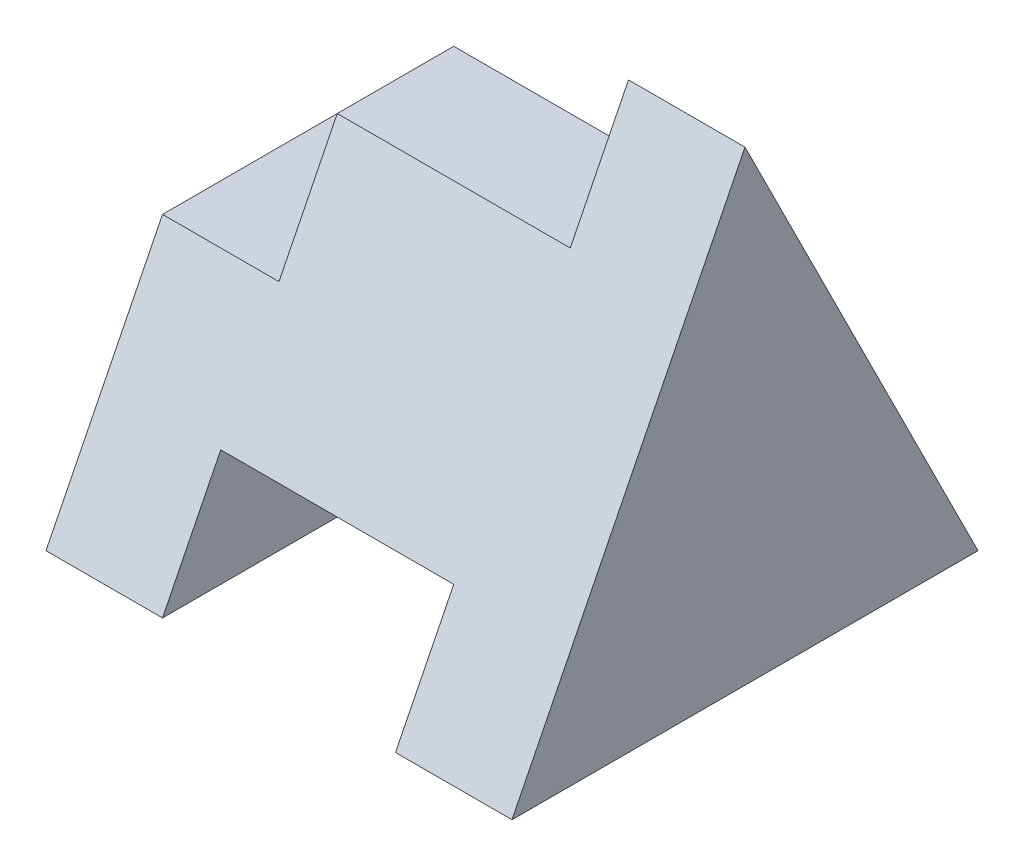
ISO-10303-21;
HEADER;
FILE_DESCRIPTION(('STEP AP214'),'2;1');
FILE_NAME('part.step','',(''),(''),'','','');
FILE_SCHEMA(('AUTOMOTIVE_DESIGN { 1 0 10303 214 1 1 1 1 }'));
ENDSEC;
DATA;
#1=APPLICATION_CONTEXT('core data for automotive mechanical design processes');
#2=APPLICATION_PROTOCOL_DEFINITION('international standard','automotive_design',2000,#1);
#3=PRODUCT_CONTEXT('',#1,'mechanical');
#4=PRODUCT('Part','Part','',(#3));
#5=PRODUCT_RELATED_PRODUCT_CATEGORY('part','',(#4));
#6=PRODUCT_DEFINITION_FORMATION('','',#4);
#7=PRODUCT_DEFINITION_CONTEXT('part definition',#1,'design');
#8=PRODUCT_DEFINITION('design','',#6,#7);
#9=PRODUCT_DEFINITION_SHAPE('','',#8);
#10=(LENGTH_UNIT() NAMED_UNIT(*) SI_UNIT(.MILLI.,.METRE.));
#11=(NAMED_UNIT(*) PLANE_ANGLE_UNIT() SI_UNIT($,.RADIAN.));
#12=(NAMED_UNIT(*) SI_UNIT($,.STERADIAN.) SOLID_ANGLE_UNIT());
#13=UNCERTAINTY_MEASURE_WITH_UNIT(LENGTH_MEASURE(1.E-05),#10,'distance_accuracy_value','');
#14=(GEOMETRIC_REPRESENTATION_CONTEXT(3) GLOBAL_UNCERTAINTY_ASSIGNED_CONTEXT((#13)) GLOBAL_UNIT_ASSIGNED_CONTEXT((#10,
#11,#12)) REPRESENTATION_CONTEXT('',''));
#15=CARTESIAN_POINT('',(0.,0.,0.));
#16=DIRECTION('',(0.,0.,1.));
#17=DIRECTION('',(1.,0.,0.));
#18=AXIS2_PLACEMENT_3D('',#15,#16,#17);
#19=CARTESIAN_POINT('',(1.,1.,4.));
#20=DIRECTION('',(-1.,0.,0.));
#21=DIRECTION('',(0.,0.,1.));
#22=AXIS2_PLACEMENT_3D('',#19,#20,#21);
#23=PLANE('',#22);
#24=DIRECTION('',(0.,0.894427190999916,-0.447213595499958));
#25=VECTOR('',#24,1.);
#26=CARTESIAN_POINT('',(1.,0.8,3.6));
#27=LINE('',#26,#25);
#28=CARTESIAN_POINT('',(0.999999999999999,0.,4.));
#29=VERTEX_POINT('',#28);
#30=CARTESIAN_POINT('',(1.,1.,3.5));
#31=VERTEX_POINT('',#30);
#32=EDGE_CURVE('E196',#29,#31,#27,.T.);
#33=ORIENTED_EDGE('',*,*,#32,.F.);
#34=DIRECTION('',(0.,0.,-1.));
#35=VECTOR('',#34,1.);
#36=CARTESIAN_POINT('',(1.,0.,4.));
#37=LINE('',#36,#35);
#38=CARTESIAN_POINT('',(0.999999999999999,0.,0.));
#39=VERTEX_POINT('',#38);
#40=EDGE_CURVE('E12',#29,#39,#37,.T.);
#41=ORIENTED_EDGE('',*,*,#40,.T.);
#42=DIRECTION('',(0.,-0.894427190999916,-0.447213595499958));
#43=VECTOR('',#42,1.);
#44=CARTESIAN_POINT('',(1.,2.4,1.2));
#45=LINE('',#44,#43);
#46=CARTESIAN_POINT('',(1.,1.,0.5));
#47=VERTEX_POINT('',#46);
#48=EDGE_CURVE('E147',#47,#39,#45,.T.);
#49=ORIENTED_EDGE('',*,*,#48,.F.);
#50=DIRECTION('',(0.,0.,-1.));
#51=VECTOR('',#50,1.);
#52=CARTESIAN_POINT('',(1.,1.,4.));
#53=LINE('',#52,#51);
#54=EDGE_CURVE('E42',#31,#47,#53,.T.);
#55=ORIENTED_EDGE('',*,*,#54,.F.);
#56=EDGE_LOOP('',(#33,#41,#49,#55));
#57=FACE_BOUND('',#56,.T.);
#58=ADVANCED_FACE('F34',(#57),#23,.F.);
#59=CARTESIAN_POINT('',(3.,1.,4.));
#60=DIRECTION('',(0.,1.,0.));
#61=DIRECTION('',(-1.,0.,0.));
#62=AXIS2_PLACEMENT_3D('',#59,#60,#61);
#63=PLANE('',#62);
#64=DIRECTION('',(1.,0.,0.));
#65=VECTOR('',#64,1.);
#66=CARTESIAN_POINT('',(3.,1.,3.5));
#67=LINE('',#66,#65);
#68=CARTESIAN_POINT('',(3.,1.,3.5));
#69=VERTEX_POINT('',#68);
#70=EDGE_CURVE('E198',#31,#69,#67,.T.);
#71=ORIENTED_EDGE('',*,*,#70,.F.);
#72=ORIENTED_EDGE('',*,*,#54,.T.);
#73=DIRECTION('',(-1.,0.,0.));
#74=VECTOR('',#73,1.);
#75=CARTESIAN_POINT('',(3.,1.,0.5));
#76=LINE('',#75,#74);
#77=CARTESIAN_POINT('',(3.,1.,0.499999999999999));
#78=VERTEX_POINT('',#77);
#79=EDGE_CURVE('E175',#78,#47,#76,.T.);
#80=ORIENTED_EDGE('',*,*,#79,.F.);
#81=DIRECTION('',(0.,0.,-1.));
#82=VECTOR('',#81,1.);
#83=CARTESIAN_POINT('',(3.,1.,4.));
#84=LINE('',#83,#82);
#85=EDGE_CURVE('E164',#69,#78,#84,.T.);
#86=ORIENTED_EDGE('',*,*,#85,.F.);
#87=EDGE_LOOP('',(#71,#72,#80,#86));
#88=FACE_BOUND('',#87,.T.);
#89=ADVANCED_FACE('F178',(#88),#63,.F.);
#90=CARTESIAN_POINT('',(3.,0.,4.));
#91=DIRECTION('',(1.,0.,0.));
#92=DIRECTION('',(0.,0.,-1.));
#93=AXIS2_PLACEMENT_3D('',#90,#91,#92);
#94=PLANE('',#93);
#95=DIRECTION('',(0.,-0.894427190999916,0.447213595499958));
#96=VECTOR('',#95,1.);
#97=CARTESIAN_POINT('',(3.,0.,4.));
#98=LINE('',#97,#96);
#99=CARTESIAN_POINT('',(3.,0.,4.));
#100=VERTEX_POINT('',#99);
#101=EDGE_CURVE('E173',#69,#100,#98,.T.);
#102=ORIENTED_EDGE('',*,*,#101,.F.);
#103=ORIENTED_EDGE('',*,*,#85,.T.);
#104=DIRECTION('',(0.,0.894427190999916,0.447213595499958));
#105=VECTOR('',#104,1.);
#106=CARTESIAN_POINT('',(3.,1.6,0.799999999999999));
#107=LINE('',#106,#105);
#108=CARTESIAN_POINT('',(3.,0.,0.));
#109=VERTEX_POINT('',#108);
#110=EDGE_CURVE('E172',#109,#78,#107,.T.);
#111=ORIENTED_EDGE('',*,*,#110,.F.);
#112=DIRECTION('',(0.,0.,-1.));
#113=VECTOR('',#112,1.);
#114=CARTESIAN_POINT('',(3.,0.,4.));
#115=LINE('',#114,#113);
#116=EDGE_CURVE('E161',#100,#109,#115,.T.);
#117=ORIENTED_EDGE('',*,*,#116,.F.);
#118=EDGE_LOOP('',(#102,#103,#111,#117));
#119=FACE_BOUND('',#118,.T.);
#120=ADVANCED_FACE('F170',(#119),#94,.F.);
#121=CARTESIAN_POINT('',(4.,4.,4.));
#122=DIRECTION('',(-1.,0.,0.));
#123=DIRECTION('',(0.,-1.,0.));
#124=AXIS2_PLACEMENT_3D('',#121,#122,#123);
#125=PLANE('',#124);
#126=DIRECTION('',(0.,0.894427190999916,-0.447213595499958));
#127=VECTOR('',#126,1.);
#128=CARTESIAN_POINT('',(4.,3.2,2.4));
#129=LINE('',#128,#127);
#130=CARTESIAN_POINT('',(4.,0.,4.));
#131=VERTEX_POINT('',#130);
#132=CARTESIAN_POINT('',(4.,4.,2.));
#133=VERTEX_POINT('',#132);
#134=EDGE_CURVE('E201',#131,#133,#129,.T.);
#135=ORIENTED_EDGE('',*,*,#134,.F.);
#136=DIRECTION('',(0.,0.,-1.));
#137=VECTOR('',#136,1.);
#138=CARTESIAN_POINT('',(4.,0.,4.));
#139=LINE('',#138,#137);
#140=CARTESIAN_POINT('',(4.,0.,0.));
#141=VERTEX_POINT('',#140);
#142=EDGE_CURVE('E158',#131,#141,#139,.T.);
#143=ORIENTED_EDGE('',*,*,#142,.T.);
#144=DIRECTION('',(0.,-0.894427190999916,-0.447213595499958));
#145=VECTOR('',#144,1.);
#146=CARTESIAN_POINT('',(4.,4.8,2.4));
#147=LINE('',#146,#145);
#148=EDGE_CURVE('E49',#133,#141,#147,.T.);
#149=ORIENTED_EDGE('',*,*,#148,.F.);
#150=EDGE_LOOP('',(#135,#143,#149));
#151=FACE_BOUND('',#150,.T.);
#152=ADVANCED_FACE('F229',(#151),#125,.F.);
#153=CARTESIAN_POINT('',(3.,3.,4.));
#154=DIRECTION('',(1.,0.,0.));
#155=DIRECTION('',(0.,0.,-1.));
#156=AXIS2_PLACEMENT_3D('',#153,#154,#155);
#157=PLANE('',#156);
#158=DIRECTION('',(0.,-0.894427190999916,0.447213595499958));
#159=VECTOR('',#158,1.);
#160=CARTESIAN_POINT('',(3.,2.4,2.8));
#161=LINE('',#160,#159);
#162=CARTESIAN_POINT('',(3.,4.,2.));
#163=VERTEX_POINT('',#162);
#164=CARTESIAN_POINT('',(3.,3.,2.5));
#165=VERTEX_POINT('',#164);
#166=EDGE_CURVE('E203',#163,#165,#161,.T.);
#167=ORIENTED_EDGE('',*,*,#166,.F.);
#168=DIRECTION('',(0.,0.894427190999916,0.447213595499958));
#169=VECTOR('',#168,1.);
#170=CARTESIAN_POINT('',(3.,4.,2.));
#171=LINE('',#170,#169);
#172=CARTESIAN_POINT('',(3.,3.,1.5));
#173=VERTEX_POINT('',#172);
#174=EDGE_CURVE('E181',#173,#163,#171,.T.);
#175=ORIENTED_EDGE('',*,*,#174,.F.);
#176=DIRECTION('',(0.,0.,-1.));
#177=VECTOR('',#176,1.);
#178=CARTESIAN_POINT('',(3.,3.,4.));
#179=LINE('',#178,#177);
#180=EDGE_CURVE('E156',#165,#173,#179,.T.);
#181=ORIENTED_EDGE('',*,*,#180,.F.);
#182=EDGE_LOOP('',(#167,#175,#181));
#183=FACE_BOUND('',#182,.T.);
#184=ADVANCED_FACE('F226',(#183),#157,.F.);
#185=CARTESIAN_POINT('',(1.,3.,4.));
#186=DIRECTION('',(0.,-1.,0.));
#187=DIRECTION('',(0.,0.,-1.));
#188=AXIS2_PLACEMENT_3D('',#185,#186,#187);
#189=PLANE('',#188);
#190=DIRECTION('',(-1.,0.,0.));
#191=VECTOR('',#190,1.);
#192=CARTESIAN_POINT('',(1.,3.,2.5));
#193=LINE('',#192,#191);
#194=CARTESIAN_POINT('',(1.,3.,2.5));
#195=VERTEX_POINT('',#194);
#196=EDGE_CURVE('E205',#165,#195,#193,.T.);
#197=ORIENTED_EDGE('',*,*,#196,.F.);
#198=ORIENTED_EDGE('',*,*,#180,.T.);
#199=DIRECTION('',(1.,0.,0.));
#200=VECTOR('',#199,1.);
#201=CARTESIAN_POINT('',(1.,3.,1.5));
#202=LINE('',#201,#200);
#203=CARTESIAN_POINT('',(1.,3.,1.5));
#204=VERTEX_POINT('',#203);
#205=EDGE_CURVE('E184',#204,#173,#202,.T.);
#206=ORIENTED_EDGE('',*,*,#205,.F.);
#207=DIRECTION('',(0.,0.,-1.));
#208=VECTOR('',#207,1.);
#209=CARTESIAN_POINT('',(1.,3.,4.));
#210=LINE('',#209,#208);
#211=EDGE_CURVE('E154',#195,#204,#210,.T.);
#212=ORIENTED_EDGE('',*,*,#211,.F.);
#213=EDGE_LOOP('',(#197,#198,#206,#212));
#214=FACE_BOUND('',#213,.T.);
#215=ADVANCED_FACE('F222',(#214),#189,.F.);
#216=CARTESIAN_POINT('',(1.,2.,4.));
#217=DIRECTION('',(1.,0.,0.));
#218=DIRECTION('',(0.,0.,-1.));
#219=AXIS2_PLACEMENT_3D('',#216,#217,#218);
#220=PLANE('',#219);
#221=DIRECTION('',(0.,-0.894427190999916,0.447213595499958));
#222=VECTOR('',#221,1.);
#223=CARTESIAN_POINT('',(1.,1.6,3.2));
#224=LINE('',#223,#222);
#225=CARTESIAN_POINT('',(1.,2.,3.));
#226=VERTEX_POINT('',#225);
#227=EDGE_CURVE('E207',#195,#226,#224,.T.);
#228=ORIENTED_EDGE('',*,*,#227,.F.);
#229=ORIENTED_EDGE('',*,*,#211,.T.);
#230=DIRECTION('',(0.,0.894427190999916,0.447213595499958));
#231=VECTOR('',#230,1.);
#232=CARTESIAN_POINT('',(1.,3.2,1.6));
#233=LINE('',#232,#231);
#234=CARTESIAN_POINT('',(1.,2.,1.));
#235=VERTEX_POINT('',#234);
#236=EDGE_CURVE('E187',#235,#204,#233,.T.);
#237=ORIENTED_EDGE('',*,*,#236,.F.);
#238=DIRECTION('',(0.,0.,-1.));
#239=VECTOR('',#238,1.);
#240=CARTESIAN_POINT('',(1.,2.,4.));
#241=LINE('',#240,#239);
#242=EDGE_CURVE('E152',#226,#235,#241,.T.);
#243=ORIENTED_EDGE('',*,*,#242,.F.);
#244=EDGE_LOOP('',(#228,#229,#237,#243));
#245=FACE_BOUND('',#244,.T.);
#246=ADVANCED_FACE('F218',(#245),#220,.F.);
#247=CARTESIAN_POINT('',(0.,2.,4.));
#248=DIRECTION('',(0.,-1.,0.));
#249=DIRECTION('',(1.,0.,0.));
#250=AXIS2_PLACEMENT_3D('',#247,#248,#249);
#251=PLANE('',#250);
#252=DIRECTION('',(-1.,0.,0.));
#253=VECTOR('',#252,1.);
#254=CARTESIAN_POINT('',(0.,2.,3.));
#255=LINE('',#254,#253);
#256=CARTESIAN_POINT('',(0.,2.,3.));
#257=VERTEX_POINT('',#256);
#258=EDGE_CURVE('E125',#226,#257,#255,.T.);
#259=ORIENTED_EDGE('',*,*,#258,.F.);
#260=ORIENTED_EDGE('',*,*,#242,.T.);
#261=DIRECTION('',(1.,0.,0.));
#262=VECTOR('',#261,1.);
#263=CARTESIAN_POINT('',(0.,2.,1.));
#264=LINE('',#263,#262);
#265=CARTESIAN_POINT('',(0.,2.,1.));
#266=VERTEX_POINT('',#265);
#267=EDGE_CURVE('E190',#266,#235,#264,.T.);
#268=ORIENTED_EDGE('',*,*,#267,.F.);
#269=DIRECTION('',(0.,0.,-1.));
#270=VECTOR('',#269,1.);
#271=CARTESIAN_POINT('',(0.,2.,4.));
#272=LINE('',#271,#270);
#273=EDGE_CURVE('E137',#257,#266,#272,.T.);
#274=ORIENTED_EDGE('',*,*,#273,.F.);
#275=EDGE_LOOP('',(#259,#260,#268,#274));
#276=FACE_BOUND('',#275,.T.);
#277=ADVANCED_FACE('F215',(#276),#251,.F.);
#278=CARTESIAN_POINT('',(0.,0.,4.));
#279=DIRECTION('',(1.,0.,0.));
#280=DIRECTION('',(0.,0.,-1.));
#281=AXIS2_PLACEMENT_3D('',#278,#279,#280);
#282=PLANE('',#281);
#283=DIRECTION('',(0.,0.894427190999916,-0.447213595499958));
#284=VECTOR('',#283,1.);
#285=CARTESIAN_POINT('',(0.,1.6,3.2));
#286=LINE('',#285,#284);
#287=CARTESIAN_POINT('',(0.,0.,4.));
#288=VERTEX_POINT('',#287);
#289=EDGE_CURVE('E118',#288,#257,#286,.T.);
#290=ORIENTED_EDGE('',*,*,#289,.T.);
#291=ORIENTED_EDGE('',*,*,#273,.T.);
#292=DIRECTION('',(0.,-0.894427190999916,-0.447213595499958));
#293=VECTOR('',#292,1.);
#294=CARTESIAN_POINT('',(0.,0.,0.));
#295=LINE('',#294,#293);
#296=CARTESIAN_POINT('',(0.,0.,0.));
#297=VERTEX_POINT('',#296);
#298=EDGE_CURVE('E134',#266,#297,#295,.T.);
#299=ORIENTED_EDGE('',*,*,#298,.T.);
#300=DIRECTION('',(0.,0.,-1.));
#301=VECTOR('',#300,1.);
#302=CARTESIAN_POINT('',(0.,0.,4.));
#303=LINE('',#302,#301);
#304=EDGE_CURVE('E131',#288,#297,#303,.T.);
#305=ORIENTED_EDGE('',*,*,#304,.F.);
#306=EDGE_LOOP('',(#290,#291,#299,#305));
#307=FACE_BOUND('',#306,.T.);
#308=ADVANCED_FACE('F132',(#307),#282,.F.);
#309=CARTESIAN_POINT('',(1.,0.,4.));
#310=DIRECTION('',(0.,1.,0.));
#311=DIRECTION('',(-1.,0.,0.));
#312=AXIS2_PLACEMENT_3D('',#309,#310,#311);
#313=PLANE('',#312);
#314=DIRECTION('',(1.,0.,0.));
#315=VECTOR('',#314,1.);
#316=CARTESIAN_POINT('',(1.,0.,0.));
#317=LINE('',#316,#315);
#318=EDGE_CURVE('E144',#297,#39,#317,.T.);
#319=ORIENTED_EDGE('',*,*,#318,.T.);
#320=ORIENTED_EDGE('',*,*,#40,.F.);
#321=DIRECTION('',(1.,0.,0.));
#322=VECTOR('',#321,1.);
#323=CARTESIAN_POINT('',(1.,0.,4.));
#324=LINE('',#323,#322);
#325=EDGE_CURVE('E122',#288,#29,#324,.T.);
#326=ORIENTED_EDGE('',*,*,#325,.F.);
#327=ORIENTED_EDGE('',*,*,#304,.T.);
#328=EDGE_LOOP('',(#319,#320,#326,#327));
#329=FACE_BOUND('',#328,.T.);
#330=ADVANCED_FACE('F36',(#329),#313,.F.);
#331=CARTESIAN_POINT('',(4.,0.,4.));
#332=DIRECTION('',(0.,1.,0.));
#333=DIRECTION('',(-1.,0.,0.));
#334=AXIS2_PLACEMENT_3D('',#331,#332,#333);
#335=PLANE('',#334);
#336=DIRECTION('',(1.,0.,0.));
#337=VECTOR('',#336,1.);
#338=CARTESIAN_POINT('',(4.,0.,0.));
#339=LINE('',#338,#337);
#340=EDGE_CURVE('E141',#109,#141,#339,.T.);
#341=ORIENTED_EDGE('',*,*,#340,.T.);
#342=ORIENTED_EDGE('',*,*,#142,.F.);
#343=DIRECTION('',(1.,0.,0.));
#344=VECTOR('',#343,1.);
#345=CARTESIAN_POINT('',(4.,0.,4.));
#346=LINE('',#345,#344);
#347=EDGE_CURVE('E138',#100,#131,#346,.T.);
#348=ORIENTED_EDGE('',*,*,#347,.F.);
#349=ORIENTED_EDGE('',*,*,#116,.T.);
#350=EDGE_LOOP('',(#341,#342,#348,#349));
#351=FACE_BOUND('',#350,.T.);
#352=ADVANCED_FACE('F233',(#351),#335,.F.);
#353=CARTESIAN_POINT('',(10.,0.,0.));
#354=DIRECTION('',(0.,0.447213595499958,-0.894427190999916));
#355=DIRECTION('',(0.,0.894427190999916,0.447213595499958));
#356=AXIS2_PLACEMENT_3D('',#353,#354,#355);
#357=PLANE('',#356);
#358=ORIENTED_EDGE('',*,*,#48,.T.);
#359=ORIENTED_EDGE('',*,*,#318,.F.);
#360=ORIENTED_EDGE('',*,*,#298,.F.);
#361=ORIENTED_EDGE('',*,*,#267,.T.);
#362=ORIENTED_EDGE('',*,*,#236,.T.);
#363=ORIENTED_EDGE('',*,*,#205,.T.);
#364=ORIENTED_EDGE('',*,*,#174,.T.);
#365=DIRECTION('',(-1.,0.,0.));
#366=VECTOR('',#365,1.);
#367=CARTESIAN_POINT('',(10.,4.,2.));
#368=LINE('',#367,#366);
#369=EDGE_CURVE('E193',#133,#163,#368,.T.);
#370=ORIENTED_EDGE('',*,*,#369,.F.);
#371=ORIENTED_EDGE('',*,*,#148,.T.);
#372=ORIENTED_EDGE('',*,*,#340,.F.);
#373=ORIENTED_EDGE('',*,*,#110,.T.);
#374=ORIENTED_EDGE('',*,*,#79,.T.);
#375=EDGE_LOOP('',(#358,#359,#360,#361,#362,#363,#364,#370,#371,#372,#373,#374));
#376=FACE_BOUND('',#375,.T.);
#377=ADVANCED_FACE('F174',(#376),#357,.T.);
#378=CARTESIAN_POINT('',(10.,1.6,3.2));
#379=DIRECTION('',(0.,0.447213595499958,0.894427190999916));
#380=DIRECTION('',(0.,-0.894427190999916,0.447213595499958));
#381=AXIS2_PLACEMENT_3D('',#378,#379,#380);
#382=PLANE('',#381);
#383=ORIENTED_EDGE('',*,*,#32,.T.);
#384=ORIENTED_EDGE('',*,*,#70,.T.);
#385=ORIENTED_EDGE('',*,*,#101,.T.);
#386=ORIENTED_EDGE('',*,*,#347,.T.);
#387=ORIENTED_EDGE('',*,*,#134,.T.);
#388=ORIENTED_EDGE('',*,*,#369,.T.);
#389=ORIENTED_EDGE('',*,*,#166,.T.);
#390=ORIENTED_EDGE('',*,*,#196,.T.);
#391=ORIENTED_EDGE('',*,*,#227,.T.);
#392=ORIENTED_EDGE('',*,*,#258,.T.);
#393=ORIENTED_EDGE('',*,*,#289,.F.);
#394=ORIENTED_EDGE('',*,*,#325,.T.);
#395=EDGE_LOOP('',(#383,#384,#385,#386,#387,#388,#389,#390,#391,#392,#393,#394));
#396=FACE_BOUND('',#395,.T.);
#397=ADVANCED_FACE('F120',(#396),#382,.T.);
#398=CLOSED_SHELL('',(#58,#89,#120,#152,#184,#215,#246,#277,#308,#330,#352,#377,#397));
#399=MANIFOLD_SOLID_BREP('B2',#398);
#400=ADVANCED_BREP_SHAPE_REPRESENTATION('',(#18,#399),#14);
#401=SHAPE_DEFINITION_REPRESENTATION(#9,#400);
ENDSEC;
END-ISO-10303-21;
